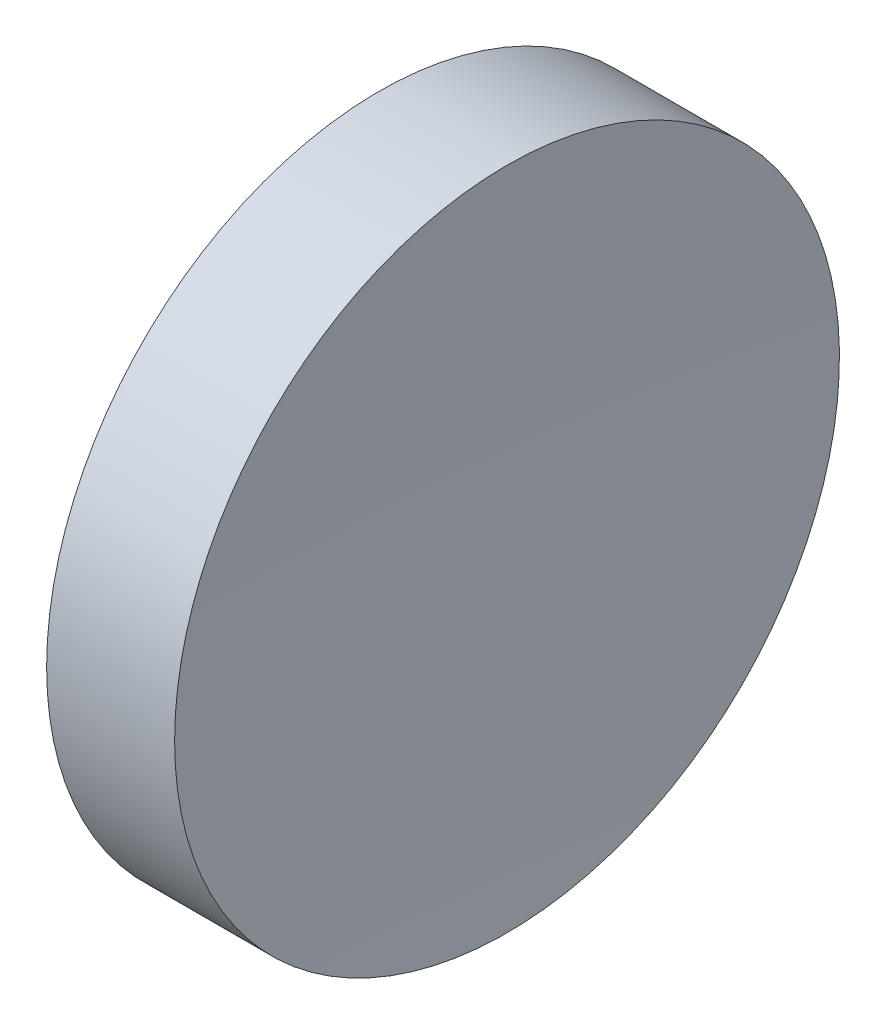
ISO-10303-21;
HEADER;
FILE_DESCRIPTION(('STEP AP214'),'2;1');
FILE_NAME('part.step','',(''),(''),'','','');
FILE_SCHEMA(('AUTOMOTIVE_DESIGN { 1 0 10303 214 1 1 1 1 }'));
ENDSEC;
DATA;
#1=APPLICATION_CONTEXT('core data for automotive mechanical design processes');
#2=APPLICATION_PROTOCOL_DEFINITION('international standard','automotive_design',2000,#1);
#3=PRODUCT_CONTEXT('',#1,'mechanical');
#4=PRODUCT('Part','Part','',(#3));
#5=PRODUCT_RELATED_PRODUCT_CATEGORY('part','',(#4));
#6=PRODUCT_DEFINITION_FORMATION('','',#4);
#7=PRODUCT_DEFINITION_CONTEXT('part definition',#1,'design');
#8=PRODUCT_DEFINITION('design','',#6,#7);
#9=PRODUCT_DEFINITION_SHAPE('','',#8);
#10=(LENGTH_UNIT() NAMED_UNIT(*) SI_UNIT(.MILLI.,.METRE.));
#11=(NAMED_UNIT(*) PLANE_ANGLE_UNIT() SI_UNIT($,.RADIAN.));
#12=(NAMED_UNIT(*) SI_UNIT($,.STERADIAN.) SOLID_ANGLE_UNIT());
#13=UNCERTAINTY_MEASURE_WITH_UNIT(LENGTH_MEASURE(1.E-05),#10,'distance_accuracy_value','');
#14=(GEOMETRIC_REPRESENTATION_CONTEXT(3) GLOBAL_UNCERTAINTY_ASSIGNED_CONTEXT((#13)) GLOBAL_UNIT_ASSIGNED_CONTEXT((#10,
#11,#12)) REPRESENTATION_CONTEXT('',''));
#15=CARTESIAN_POINT('',(0.,0.,0.));
#16=DIRECTION('',(0.,0.,1.));
#17=DIRECTION('',(1.,0.,0.));
#18=AXIS2_PLACEMENT_3D('',#15,#16,#17);
#19=CARTESIAN_POINT('',(739.185311069087,138.756042246745,0.));
#20=DIRECTION('',(-1.,0.,0.));
#21=DIRECTION('',(0.,1.,0.));
#22=AXIS2_PLACEMENT_3D('',#19,#20,#21);
#23=SPHERICAL_SURFACE('',#22,500.);
#24=CARTESIAN_POINT('',(239.810702183132,138.756042246745,0.));
#25=DIRECTION('',(-1.,0.,0.));
#26=DIRECTION('',(0.,0.,1.));
#27=AXIS2_PLACEMENT_3D('',#24,#25,#26);
#28=CIRCLE('',#27,25.);
#29=CARTESIAN_POINT('',(239.810702183132,138.756042246745,25.));
#30=VERTEX_POINT('',#29);
#31=EDGE_CURVE('E10',#30,#30,#28,.T.);
#32=ORIENTED_EDGE('',*,*,#31,.F.);
#33=EDGE_LOOP('',(#32));
#34=FACE_BOUND('',#33,.T.);
#35=ADVANCED_FACE('F35',(#34),#23,.F.);
#36=CARTESIAN_POINT('',(217.97028600433,138.756042246745,0.));
#37=DIRECTION('',(-1.,0.,0.));
#38=DIRECTION('',(0.,0.,1.));
#39=AXIS2_PLACEMENT_3D('',#36,#37,#38);
#40=CYLINDRICAL_SURFACE('',#39,25.);
#41=CARTESIAN_POINT('',(230.185311069839,138.756042246745,0.));
#42=DIRECTION('',(-1.,0.,0.));
#43=DIRECTION('',(0.,0.,1.));
#44=AXIS2_PLACEMENT_3D('',#41,#42,#43);
#45=CIRCLE('',#44,25.);
#46=CARTESIAN_POINT('',(230.185311069839,138.756042246745,25.));
#47=VERTEX_POINT('',#46);
#48=EDGE_CURVE('E41',#47,#47,#45,.T.);
#49=ORIENTED_EDGE('',*,*,#48,.F.);
#50=EDGE_LOOP('',(#49));
#51=FACE_BOUND('',#50,.T.);
#52=ORIENTED_EDGE('',*,*,#31,.T.);
#53=EDGE_LOOP('',(#52));
#54=FACE_BOUND('',#53,.T.);
#55=ADVANCED_FACE('F49',(#51,#54),#40,.T.);
#56=CARTESIAN_POINT('',(230.185311069839,138.756042246745,0.));
#57=DIRECTION('',(1.,0.,0.));
#58=DIRECTION('',(0.,0.,-1.));
#59=AXIS2_PLACEMENT_3D('',#56,#57,#58);
#60=PLANE('',#59);
#61=ORIENTED_EDGE('',*,*,#48,.T.);
#62=EDGE_LOOP('',(#61));
#63=FACE_BOUND('',#62,.T.);
#64=ADVANCED_FACE('F47',(#63),#60,.F.);
#65=CLOSED_SHELL('',(#35,#55,#64));
#66=MANIFOLD_SOLID_BREP('B2',#65);
#67=ADVANCED_BREP_SHAPE_REPRESENTATION('',(#18,#66),#14);
#68=SHAPE_DEFINITION_REPRESENTATION(#9,#67);
ENDSEC;
END-ISO-10303-21;
